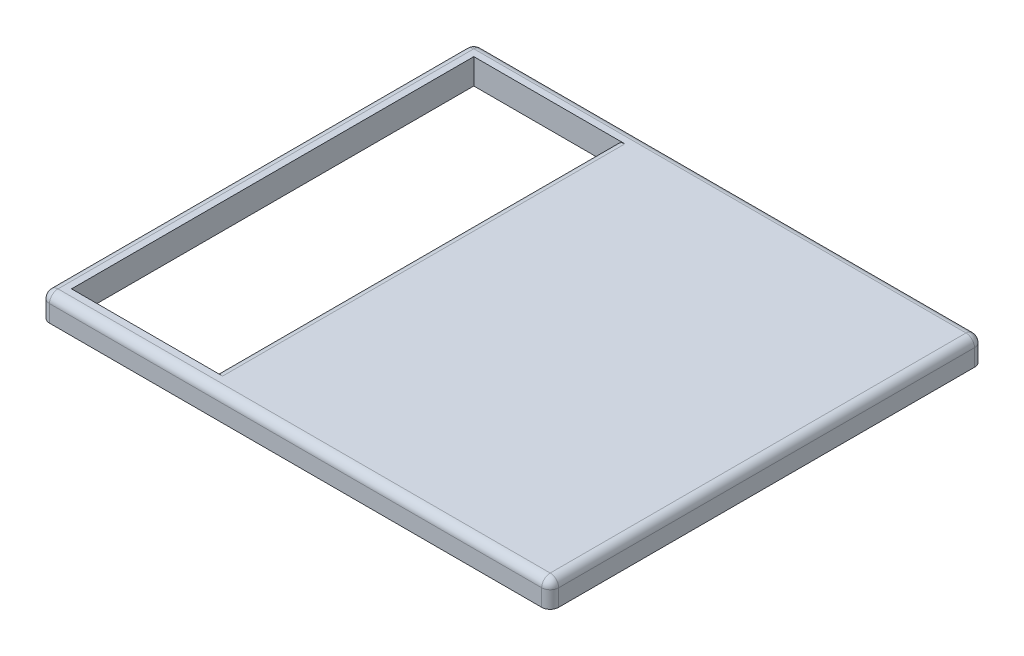
ISO-10303-21;
HEADER;
FILE_DESCRIPTION(('STEP AP214'),'2;1');
FILE_NAME('part.step','',(''),(''),'','','');
FILE_SCHEMA(('AUTOMOTIVE_DESIGN { 1 0 10303 214 1 1 1 1 }'));
ENDSEC;
DATA;
#1=APPLICATION_CONTEXT('core data for automotive mechanical design processes');
#2=APPLICATION_PROTOCOL_DEFINITION('international standard','automotive_design',2000,#1);
#3=PRODUCT_CONTEXT('',#1,'mechanical');
#4=PRODUCT('Part','Part','',(#3));
#5=PRODUCT_RELATED_PRODUCT_CATEGORY('part','',(#4));
#6=PRODUCT_DEFINITION_FORMATION('','',#4);
#7=PRODUCT_DEFINITION_CONTEXT('part definition',#1,'design');
#8=PRODUCT_DEFINITION('design','',#6,#7);
#9=PRODUCT_DEFINITION_SHAPE('','',#8);
#10=(LENGTH_UNIT() NAMED_UNIT(*) SI_UNIT(.MILLI.,.METRE.));
#11=(NAMED_UNIT(*) PLANE_ANGLE_UNIT() SI_UNIT($,.RADIAN.));
#12=(NAMED_UNIT(*) SI_UNIT($,.STERADIAN.) SOLID_ANGLE_UNIT());
#13=UNCERTAINTY_MEASURE_WITH_UNIT(LENGTH_MEASURE(1.E-05),#10,'distance_accuracy_value','');
#14=(GEOMETRIC_REPRESENTATION_CONTEXT(3) GLOBAL_UNCERTAINTY_ASSIGNED_CONTEXT((#13)) GLOBAL_UNIT_ASSIGNED_CONTEXT((#10,
#11,#12)) REPRESENTATION_CONTEXT('',''));
#15=CARTESIAN_POINT('',(0.,0.,0.));
#16=DIRECTION('',(0.,0.,1.));
#17=DIRECTION('',(1.,0.,0.));
#18=AXIS2_PLACEMENT_3D('',#15,#16,#17);
#19=CARTESIAN_POINT('',(0.,20.,0.));
#20=DIRECTION('',(0.,1.,0.));
#21=DIRECTION('',(0.,0.,1.));
#22=AXIS2_PLACEMENT_3D('',#19,#20,#21);
#23=PLANE('',#22);
#24=CARTESIAN_POINT('',(33.33,20.,38.33));
#25=DIRECTION('',(0.,1.,0.));
#26=DIRECTION('',(0.,0.,1.));
#27=AXIS2_PLACEMENT_3D('',#24,#25,#26);
#28=CIRCLE('',#27,1.67);
#29=CARTESIAN_POINT('',(35.,20.,38.33));
#30=VERTEX_POINT('',#29);
#31=CARTESIAN_POINT('',(33.33,20.,40.));
#32=VERTEX_POINT('',#31);
#33=EDGE_CURVE('E289',#30,#32,#28,.F.);
#34=ORIENTED_EDGE('',*,*,#33,.T.);
#35=DIRECTION('',(-1.,0.,0.));
#36=VECTOR('',#35,1.);
#37=CARTESIAN_POINT('',(0.,20.,40.));
#38=LINE('',#37,#36);
#39=CARTESIAN_POINT('',(-63.33,20.,40.));
#40=VERTEX_POINT('',#39);
#41=EDGE_CURVE('E293',#32,#40,#38,.T.);
#42=ORIENTED_EDGE('',*,*,#41,.T.);
#43=CARTESIAN_POINT('',(-63.33,20.,38.33));
#44=DIRECTION('',(0.,1.,0.));
#45=DIRECTION('',(0.,0.,1.));
#46=AXIS2_PLACEMENT_3D('',#43,#44,#45);
#47=CIRCLE('',#46,1.67);
#48=CARTESIAN_POINT('',(-65.,20.,38.33));
#49=VERTEX_POINT('',#48);
#50=EDGE_CURVE('E48',#40,#49,#47,.F.);
#51=ORIENTED_EDGE('',*,*,#50,.T.);
#52=DIRECTION('',(0.,0.,-1.));
#53=VECTOR('',#52,1.);
#54=CARTESIAN_POINT('',(-65.,20.,0.));
#55=LINE('',#54,#53);
#56=CARTESIAN_POINT('',(-65.,20.,-43.33));
#57=VERTEX_POINT('',#56);
#58=EDGE_CURVE('E291',#49,#57,#55,.T.);
#59=ORIENTED_EDGE('',*,*,#58,.T.);
#60=CARTESIAN_POINT('',(-63.33,20.,-43.33));
#61=DIRECTION('',(0.,1.,0.));
#62=DIRECTION('',(0.,0.,1.));
#63=AXIS2_PLACEMENT_3D('',#60,#61,#62);
#64=CIRCLE('',#63,1.67);
#65=CARTESIAN_POINT('',(-63.33,20.,-45.));
#66=VERTEX_POINT('',#65);
#67=EDGE_CURVE('E11',#57,#66,#64,.F.);
#68=ORIENTED_EDGE('',*,*,#67,.T.);
#69=DIRECTION('',(1.,0.,0.));
#70=VECTOR('',#69,1.);
#71=CARTESIAN_POINT('',(0.,20.,-45.));
#72=LINE('',#71,#70);
#73=CARTESIAN_POINT('',(33.33,20.,-45.));
#74=VERTEX_POINT('',#73);
#75=EDGE_CURVE('E62',#66,#74,#72,.T.);
#76=ORIENTED_EDGE('',*,*,#75,.T.);
#77=CARTESIAN_POINT('',(33.33,20.,-43.33));
#78=DIRECTION('',(0.,1.,0.));
#79=DIRECTION('',(0.,0.,1.));
#80=AXIS2_PLACEMENT_3D('',#77,#78,#79);
#81=CIRCLE('',#80,1.67);
#82=CARTESIAN_POINT('',(35.,20.,-43.33));
#83=VERTEX_POINT('',#82);
#84=EDGE_CURVE('E296',#74,#83,#81,.F.);
#85=ORIENTED_EDGE('',*,*,#84,.T.);
#86=DIRECTION('',(0.,0.,1.));
#87=VECTOR('',#86,1.);
#88=CARTESIAN_POINT('',(35.,20.,0.));
#89=LINE('',#88,#87);
#90=EDGE_CURVE('E290',#83,#30,#89,.T.);
#91=ORIENTED_EDGE('',*,*,#90,.T.);
#92=EDGE_LOOP('',(#34,#42,#51,#59,#68,#76,#85,#91));
#93=FACE_BOUND('',#92,.T.);
#94=DIRECTION('',(0.,0.,-1.));
#95=VECTOR('',#94,1.);
#96=CARTESIAN_POINT('',(-62.,20.,-42.));
#97=LINE('',#96,#95);
#98=CARTESIAN_POINT('',(-62.,20.,37.));
#99=VERTEX_POINT('',#98);
#100=CARTESIAN_POINT('',(-62.,20.,-42.));
#101=VERTEX_POINT('',#100);
#102=EDGE_CURVE('E259',#99,#101,#97,.T.);
#103=ORIENTED_EDGE('',*,*,#102,.F.);
#104=DIRECTION('',(-1.,0.,0.));
#105=VECTOR('',#104,1.);
#106=CARTESIAN_POINT('',(-62.,20.,37.));
#107=LINE('',#106,#105);
#108=CARTESIAN_POINT('',(32.,20.,37.));
#109=VERTEX_POINT('',#108);
#110=EDGE_CURVE('E306',#109,#99,#107,.T.);
#111=ORIENTED_EDGE('',*,*,#110,.F.);
#112=DIRECTION('',(0.,0.,1.));
#113=VECTOR('',#112,1.);
#114=CARTESIAN_POINT('',(32.,20.,37.));
#115=LINE('',#114,#113);
#116=CARTESIAN_POINT('',(32.,20.,-42.));
#117=VERTEX_POINT('',#116);
#118=EDGE_CURVE('E307',#117,#109,#115,.T.);
#119=ORIENTED_EDGE('',*,*,#118,.F.);
#120=DIRECTION('',(1.,0.,0.));
#121=VECTOR('',#120,1.);
#122=CARTESIAN_POINT('',(32.,20.,-42.));
#123=LINE('',#122,#121);
#124=EDGE_CURVE('E43',#101,#117,#123,.T.);
#125=ORIENTED_EDGE('',*,*,#124,.F.);
#126=EDGE_LOOP('',(#103,#111,#119,#125));
#127=FACE_BOUND('',#126,.T.);
#128=ADVANCED_FACE('F40',(#93,#127),#23,.F.);
#129=CARTESIAN_POINT('',(32.,3.,-42.));
#130=DIRECTION('',(0.,0.,-1.));
#131=DIRECTION('',(-1.,0.,0.));
#132=AXIS2_PLACEMENT_3D('',#129,#130,#131);
#133=PLANE('',#132);
#134=DIRECTION('',(0.,1.,0.));
#135=VECTOR('',#134,1.);
#136=CARTESIAN_POINT('',(-62.,3.,-42.));
#137=LINE('',#136,#135);
#138=CARTESIAN_POINT('',(-62.,25.,-42.));
#139=VERTEX_POINT('',#138);
#140=EDGE_CURVE('E200',#101,#139,#137,.T.);
#141=ORIENTED_EDGE('',*,*,#140,.F.);
#142=ORIENTED_EDGE('',*,*,#124,.T.);
#143=DIRECTION('',(0.,1.,0.));
#144=VECTOR('',#143,1.);
#145=CARTESIAN_POINT('',(32.,3.,-42.));
#146=LINE('',#145,#144);
#147=CARTESIAN_POINT('',(32.,23.,-42.));
#148=VERTEX_POINT('',#147);
#149=EDGE_CURVE('E160',#117,#148,#146,.T.);
#150=ORIENTED_EDGE('',*,*,#149,.T.);
#151=DIRECTION('',(1.,0.,0.));
#152=VECTOR('',#151,1.);
#153=CARTESIAN_POINT('',(32.,23.,-42.));
#154=LINE('',#153,#152);
#155=CARTESIAN_POINT('',(-34.,23.,-42.));
#156=VERTEX_POINT('',#155);
#157=EDGE_CURVE('E165',#156,#148,#154,.T.);
#158=ORIENTED_EDGE('',*,*,#157,.F.);
#159=DIRECTION('',(0.,1.,0.));
#160=VECTOR('',#159,1.);
#161=CARTESIAN_POINT('',(-34.,3.,-42.));
#162=LINE('',#161,#160);
#163=CARTESIAN_POINT('',(-34.,23.33,-42.));
#164=VERTEX_POINT('',#163);
#165=EDGE_CURVE('E182',#156,#164,#162,.T.);
#166=ORIENTED_EDGE('',*,*,#165,.T.);
#167=CARTESIAN_POINT('',(-32.33,23.33,-42.));
#168=DIRECTION('',(0.,0.,-1.));
#169=DIRECTION('',(-1.,0.,0.));
#170=AXIS2_PLACEMENT_3D('',#167,#168,#169);
#171=CIRCLE('',#170,1.67);
#172=CARTESIAN_POINT('',(-32.33,25.,-42.));
#173=VERTEX_POINT('',#172);
#174=EDGE_CURVE('E254',#164,#173,#171,.T.);
#175=ORIENTED_EDGE('',*,*,#174,.T.);
#176=DIRECTION('',(-1.,0.,0.));
#177=VECTOR('',#176,1.);
#178=CARTESIAN_POINT('',(32.,25.,-42.));
#179=LINE('',#178,#177);
#180=EDGE_CURVE('E181',#173,#139,#179,.T.);
#181=ORIENTED_EDGE('',*,*,#180,.T.);
#182=EDGE_LOOP('',(#141,#142,#150,#158,#166,#175,#181));
#183=FACE_BOUND('',#182,.T.);
#184=ADVANCED_FACE('F163',(#183),#133,.F.);
#185=CARTESIAN_POINT('',(32.,3.,37.));
#186=DIRECTION('',(1.,0.,0.));
#187=DIRECTION('',(0.,0.,-1.));
#188=AXIS2_PLACEMENT_3D('',#185,#186,#187);
#189=PLANE('',#188);
#190=ORIENTED_EDGE('',*,*,#149,.F.);
#191=ORIENTED_EDGE('',*,*,#118,.T.);
#192=DIRECTION('',(0.,1.,0.));
#193=VECTOR('',#192,1.);
#194=CARTESIAN_POINT('',(32.,3.,37.));
#195=LINE('',#194,#193);
#196=CARTESIAN_POINT('',(32.,23.,37.));
#197=VERTEX_POINT('',#196);
#198=EDGE_CURVE('E170',#109,#197,#195,.T.);
#199=ORIENTED_EDGE('',*,*,#198,.T.);
#200=DIRECTION('',(0.,0.,1.));
#201=VECTOR('',#200,1.);
#202=CARTESIAN_POINT('',(32.,23.,-45.));
#203=LINE('',#202,#201);
#204=EDGE_CURVE('E177',#148,#197,#203,.T.);
#205=ORIENTED_EDGE('',*,*,#204,.F.);
#206=EDGE_LOOP('',(#190,#191,#199,#205));
#207=FACE_BOUND('',#206,.T.);
#208=ADVANCED_FACE('F184',(#207),#189,.F.);
#209=CARTESIAN_POINT('',(-62.,3.,37.));
#210=DIRECTION('',(0.,0.,1.));
#211=DIRECTION('',(1.,0.,0.));
#212=AXIS2_PLACEMENT_3D('',#209,#210,#211);
#213=PLANE('',#212);
#214=ORIENTED_EDGE('',*,*,#198,.F.);
#215=ORIENTED_EDGE('',*,*,#110,.T.);
#216=DIRECTION('',(0.,1.,0.));
#217=VECTOR('',#216,1.);
#218=CARTESIAN_POINT('',(-62.,3.,37.));
#219=LINE('',#218,#217);
#220=CARTESIAN_POINT('',(-62.,25.,37.));
#221=VERTEX_POINT('',#220);
#222=EDGE_CURVE('E203',#99,#221,#219,.T.);
#223=ORIENTED_EDGE('',*,*,#222,.T.);
#224=DIRECTION('',(1.,0.,0.));
#225=VECTOR('',#224,1.);
#226=CARTESIAN_POINT('',(-62.,25.,37.));
#227=LINE('',#226,#225);
#228=CARTESIAN_POINT('',(-32.33,25.,37.));
#229=VERTEX_POINT('',#228);
#230=EDGE_CURVE('E199',#221,#229,#227,.T.);
#231=ORIENTED_EDGE('',*,*,#230,.T.);
#232=CARTESIAN_POINT('',(-32.33,23.33,37.));
#233=DIRECTION('',(0.,0.,1.));
#234=DIRECTION('',(1.,0.,0.));
#235=AXIS2_PLACEMENT_3D('',#232,#233,#234);
#236=CIRCLE('',#235,1.67);
#237=CARTESIAN_POINT('',(-34.,23.33,37.));
#238=VERTEX_POINT('',#237);
#239=EDGE_CURVE('E257',#229,#238,#236,.T.);
#240=ORIENTED_EDGE('',*,*,#239,.T.);
#241=DIRECTION('',(0.,-1.,0.));
#242=VECTOR('',#241,1.);
#243=CARTESIAN_POINT('',(-34.,3.,37.));
#244=LINE('',#243,#242);
#245=CARTESIAN_POINT('',(-34.,23.,37.));
#246=VERTEX_POINT('',#245);
#247=EDGE_CURVE('E169',#238,#246,#244,.T.);
#248=ORIENTED_EDGE('',*,*,#247,.T.);
#249=DIRECTION('',(-1.,0.,0.));
#250=VECTOR('',#249,1.);
#251=CARTESIAN_POINT('',(-62.,23.,37.));
#252=LINE('',#251,#250);
#253=EDGE_CURVE('E207',#197,#246,#252,.T.);
#254=ORIENTED_EDGE('',*,*,#253,.F.);
#255=EDGE_LOOP('',(#214,#215,#223,#231,#240,#248,#254));
#256=FACE_BOUND('',#255,.T.);
#257=ADVANCED_FACE('F313',(#256),#213,.F.);
#258=CARTESIAN_POINT('',(-65.,25.,0.));
#259=DIRECTION('',(-1.,0.,0.));
#260=DIRECTION('',(0.,0.,1.));
#261=AXIS2_PLACEMENT_3D('',#258,#259,#260);
#262=PLANE('',#261);
#263=ORIENTED_EDGE('',*,*,#58,.F.);
#264=DIRECTION('',(0.,-1.,0.));
#265=VECTOR('',#264,1.);
#266=CARTESIAN_POINT('',(-65.,25.,38.33));
#267=LINE('',#266,#265);
#268=CARTESIAN_POINT('',(-65.,23.33,38.33));
#269=VERTEX_POINT('',#268);
#270=EDGE_CURVE('E230',#49,#269,#267,.F.);
#271=ORIENTED_EDGE('',*,*,#270,.T.);
#272=DIRECTION('',(0.,0.,-1.));
#273=VECTOR('',#272,1.);
#274=CARTESIAN_POINT('',(-65.,23.33,0.));
#275=LINE('',#274,#273);
#276=CARTESIAN_POINT('',(-65.,23.33,-43.33));
#277=VERTEX_POINT('',#276);
#278=EDGE_CURVE('E227',#269,#277,#275,.T.);
#279=ORIENTED_EDGE('',*,*,#278,.T.);
#280=DIRECTION('',(0.,-1.,0.));
#281=VECTOR('',#280,1.);
#282=CARTESIAN_POINT('',(-65.,25.,-43.33));
#283=LINE('',#282,#281);
#284=EDGE_CURVE('E224',#277,#57,#283,.T.);
#285=ORIENTED_EDGE('',*,*,#284,.T.);
#286=EDGE_LOOP('',(#263,#271,#279,#285));
#287=FACE_BOUND('',#286,.T.);
#288=ADVANCED_FACE('F431',(#287),#262,.T.);
#289=CARTESIAN_POINT('',(0.,25.,40.));
#290=DIRECTION('',(0.,0.,1.));
#291=DIRECTION('',(1.,0.,0.));
#292=AXIS2_PLACEMENT_3D('',#289,#290,#291);
#293=PLANE('',#292);
#294=ORIENTED_EDGE('',*,*,#41,.F.);
#295=DIRECTION('',(0.,-1.,0.));
#296=VECTOR('',#295,1.);
#297=CARTESIAN_POINT('',(33.33,25.,40.));
#298=LINE('',#297,#296);
#299=CARTESIAN_POINT('',(33.33,23.33,40.));
#300=VERTEX_POINT('',#299);
#301=EDGE_CURVE('E245',#32,#300,#298,.F.);
#302=ORIENTED_EDGE('',*,*,#301,.T.);
#303=DIRECTION('',(-1.,0.,0.));
#304=VECTOR('',#303,1.);
#305=CARTESIAN_POINT('',(0.,23.33,40.));
#306=LINE('',#305,#304);
#307=CARTESIAN_POINT('',(-63.33,23.33,40.));
#308=VERTEX_POINT('',#307);
#309=EDGE_CURVE('E242',#300,#308,#306,.T.);
#310=ORIENTED_EDGE('',*,*,#309,.T.);
#311=DIRECTION('',(0.,-1.,0.));
#312=VECTOR('',#311,1.);
#313=CARTESIAN_POINT('',(-63.33,25.,40.));
#314=LINE('',#313,#312);
#315=EDGE_CURVE('E239',#308,#40,#314,.T.);
#316=ORIENTED_EDGE('',*,*,#315,.T.);
#317=EDGE_LOOP('',(#294,#302,#310,#316));
#318=FACE_BOUND('',#317,.T.);
#319=ADVANCED_FACE('F426',(#318),#293,.T.);
#320=CARTESIAN_POINT('',(35.,25.,0.));
#321=DIRECTION('',(1.,0.,0.));
#322=DIRECTION('',(0.,0.,-1.));
#323=AXIS2_PLACEMENT_3D('',#320,#321,#322);
#324=PLANE('',#323);
#325=ORIENTED_EDGE('',*,*,#90,.F.);
#326=DIRECTION('',(0.,-1.,0.));
#327=VECTOR('',#326,1.);
#328=CARTESIAN_POINT('',(35.,25.,-43.33));
#329=LINE('',#328,#327);
#330=CARTESIAN_POINT('',(35.,23.33,-43.33));
#331=VERTEX_POINT('',#330);
#332=EDGE_CURVE('E232',#83,#331,#329,.F.);
#333=ORIENTED_EDGE('',*,*,#332,.T.);
#334=DIRECTION('',(0.,0.,1.));
#335=VECTOR('',#334,1.);
#336=CARTESIAN_POINT('',(35.,23.33,0.));
#337=LINE('',#336,#335);
#338=CARTESIAN_POINT('',(35.,23.33,38.33));
#339=VERTEX_POINT('',#338);
#340=EDGE_CURVE('E234',#331,#339,#337,.T.);
#341=ORIENTED_EDGE('',*,*,#340,.T.);
#342=DIRECTION('',(0.,-1.,0.));
#343=VECTOR('',#342,1.);
#344=CARTESIAN_POINT('',(35.,25.,38.33));
#345=LINE('',#344,#343);
#346=EDGE_CURVE('E236',#339,#30,#345,.T.);
#347=ORIENTED_EDGE('',*,*,#346,.T.);
#348=EDGE_LOOP('',(#325,#333,#341,#347));
#349=FACE_BOUND('',#348,.T.);
#350=ADVANCED_FACE('F408',(#349),#324,.T.);
#351=CARTESIAN_POINT('',(0.,25.,-45.));
#352=DIRECTION('',(0.,0.,-1.));
#353=DIRECTION('',(-1.,0.,0.));
#354=AXIS2_PLACEMENT_3D('',#351,#352,#353);
#355=PLANE('',#354);
#356=ORIENTED_EDGE('',*,*,#75,.F.);
#357=DIRECTION('',(0.,-1.,0.));
#358=VECTOR('',#357,1.);
#359=CARTESIAN_POINT('',(-63.33,25.,-45.));
#360=LINE('',#359,#358);
#361=CARTESIAN_POINT('',(-63.33,23.33,-45.));
#362=VERTEX_POINT('',#361);
#363=EDGE_CURVE('E252',#66,#362,#360,.F.);
#364=ORIENTED_EDGE('',*,*,#363,.T.);
#365=DIRECTION('',(1.,0.,0.));
#366=VECTOR('',#365,1.);
#367=CARTESIAN_POINT('',(0.,23.33,-45.));
#368=LINE('',#367,#366);
#369=CARTESIAN_POINT('',(33.33,23.33,-45.));
#370=VERTEX_POINT('',#369);
#371=EDGE_CURVE('E249',#362,#370,#368,.T.);
#372=ORIENTED_EDGE('',*,*,#371,.T.);
#373=DIRECTION('',(0.,-1.,0.));
#374=VECTOR('',#373,1.);
#375=CARTESIAN_POINT('',(33.33,25.,-45.));
#376=LINE('',#375,#374);
#377=EDGE_CURVE('E247',#370,#74,#376,.T.);
#378=ORIENTED_EDGE('',*,*,#377,.T.);
#379=EDGE_LOOP('',(#356,#364,#372,#378));
#380=FACE_BOUND('',#379,.T.);
#381=ADVANCED_FACE('F336',(#380),#355,.T.);
#382=CARTESIAN_POINT('',(0.,25.,0.));
#383=DIRECTION('',(0.,1.,0.));
#384=DIRECTION('',(0.,0.,1.));
#385=AXIS2_PLACEMENT_3D('',#382,#383,#384);
#386=PLANE('',#385);
#387=DIRECTION('',(1.,0.,0.));
#388=VECTOR('',#387,1.);
#389=CARTESIAN_POINT('',(0.,25.,-43.33));
#390=LINE('',#389,#388);
#391=CARTESIAN_POINT('',(33.33,25.,-43.33));
#392=VERTEX_POINT('',#391);
#393=CARTESIAN_POINT('',(-63.33,25.,-43.33));
#394=VERTEX_POINT('',#393);
#395=EDGE_CURVE('E214',#392,#394,#390,.F.);
#396=ORIENTED_EDGE('',*,*,#395,.T.);
#397=DIRECTION('',(0.,0.,-1.));
#398=VECTOR('',#397,1.);
#399=CARTESIAN_POINT('',(-63.33,25.,0.));
#400=LINE('',#399,#398);
#401=CARTESIAN_POINT('',(-63.33,25.,38.33));
#402=VERTEX_POINT('',#401);
#403=EDGE_CURVE('E218',#394,#402,#400,.F.);
#404=ORIENTED_EDGE('',*,*,#403,.T.);
#405=DIRECTION('',(-1.,0.,0.));
#406=VECTOR('',#405,1.);
#407=CARTESIAN_POINT('',(0.,25.,38.33));
#408=LINE('',#407,#406);
#409=CARTESIAN_POINT('',(33.33,25.,38.33));
#410=VERTEX_POINT('',#409);
#411=EDGE_CURVE('E216',#402,#410,#408,.F.);
#412=ORIENTED_EDGE('',*,*,#411,.T.);
#413=DIRECTION('',(0.,0.,1.));
#414=VECTOR('',#413,1.);
#415=CARTESIAN_POINT('',(33.33,25.,0.));
#416=LINE('',#415,#414);
#417=EDGE_CURVE('E212',#410,#392,#416,.F.);
#418=ORIENTED_EDGE('',*,*,#417,.T.);
#419=EDGE_LOOP('',(#396,#404,#412,#418));
#420=FACE_BOUND('',#419,.T.);
#421=ORIENTED_EDGE('',*,*,#180,.F.);
#422=DIRECTION('',(0.,0.,-1.));
#423=VECTOR('',#422,1.);
#424=CARTESIAN_POINT('',(-32.33,25.,0.));
#425=LINE('',#424,#423);
#426=EDGE_CURVE('E221',#173,#229,#425,.F.);
#427=ORIENTED_EDGE('',*,*,#426,.T.);
#428=ORIENTED_EDGE('',*,*,#230,.F.);
#429=DIRECTION('',(0.,0.,1.));
#430=VECTOR('',#429,1.);
#431=CARTESIAN_POINT('',(-62.,25.,-42.));
#432=LINE('',#431,#430);
#433=EDGE_CURVE('E196',#139,#221,#432,.T.);
#434=ORIENTED_EDGE('',*,*,#433,.F.);
#435=EDGE_LOOP('',(#421,#427,#428,#434));
#436=FACE_BOUND('',#435,.T.);
#437=ADVANCED_FACE('F325',(#420,#436),#386,.T.);
#438=CARTESIAN_POINT('',(-62.,3.,-42.));
#439=DIRECTION('',(-1.,0.,0.));
#440=DIRECTION('',(0.,0.,1.));
#441=AXIS2_PLACEMENT_3D('',#438,#439,#440);
#442=PLANE('',#441);
#443=ORIENTED_EDGE('',*,*,#222,.F.);
#444=ORIENTED_EDGE('',*,*,#102,.T.);
#445=ORIENTED_EDGE('',*,*,#140,.T.);
#446=ORIENTED_EDGE('',*,*,#433,.T.);
#447=EDGE_LOOP('',(#443,#444,#445,#446));
#448=FACE_BOUND('',#447,.T.);
#449=ADVANCED_FACE('F327',(#448),#442,.F.);
#450=CARTESIAN_POINT('',(-34.,23.,-45.));
#451=DIRECTION('',(0.,1.,0.));
#452=DIRECTION('',(0.,0.,1.));
#453=AXIS2_PLACEMENT_3D('',#450,#451,#452);
#454=PLANE('',#453);
#455=DIRECTION('',(0.,0.,1.));
#456=VECTOR('',#455,1.);
#457=CARTESIAN_POINT('',(-34.,23.,-45.));
#458=LINE('',#457,#456);
#459=EDGE_CURVE('E180',#156,#246,#458,.T.);
#460=ORIENTED_EDGE('',*,*,#459,.F.);
#461=ORIENTED_EDGE('',*,*,#157,.T.);
#462=ORIENTED_EDGE('',*,*,#204,.T.);
#463=ORIENTED_EDGE('',*,*,#253,.T.);
#464=EDGE_LOOP('',(#460,#461,#462,#463));
#465=FACE_BOUND('',#464,.T.);
#466=ADVANCED_FACE('F175',(#465),#454,.F.);
#467=CARTESIAN_POINT('',(-34.,0.,0.));
#468=DIRECTION('',(-1.,0.,0.));
#469=DIRECTION('',(0.,0.,1.));
#470=AXIS2_PLACEMENT_3D('',#467,#468,#469);
#471=PLANE('',#470);
#472=ORIENTED_EDGE('',*,*,#247,.F.);
#473=DIRECTION('',(0.,0.,-1.));
#474=VECTOR('',#473,1.);
#475=CARTESIAN_POINT('',(-34.,23.33,0.));
#476=LINE('',#475,#474);
#477=EDGE_CURVE('E209',#238,#164,#476,.T.);
#478=ORIENTED_EDGE('',*,*,#477,.T.);
#479=ORIENTED_EDGE('',*,*,#165,.F.);
#480=ORIENTED_EDGE('',*,*,#459,.T.);
#481=EDGE_LOOP('',(#472,#478,#479,#480));
#482=FACE_BOUND('',#481,.T.);
#483=ADVANCED_FACE('F318',(#482),#471,.T.);
#484=CARTESIAN_POINT('',(-32.33,23.33,0.));
#485=DIRECTION('',(0.,0.,-1.));
#486=DIRECTION('',(-1.,0.,0.));
#487=AXIS2_PLACEMENT_3D('',#484,#485,#486);
#488=CYLINDRICAL_SURFACE('',#487,1.67);
#489=ORIENTED_EDGE('',*,*,#239,.F.);
#490=ORIENTED_EDGE('',*,*,#426,.F.);
#491=ORIENTED_EDGE('',*,*,#174,.F.);
#492=ORIENTED_EDGE('',*,*,#477,.F.);
#493=EDGE_LOOP('',(#489,#490,#491,#492));
#494=FACE_BOUND('',#493,.T.);
#495=ADVANCED_FACE('F322',(#494),#488,.T.);
#496=CARTESIAN_POINT('',(33.33,25.,38.33));
#497=DIRECTION('',(0.,-1.,0.));
#498=DIRECTION('',(0.,0.,-1.));
#499=AXIS2_PLACEMENT_3D('',#496,#497,#498);
#500=CYLINDRICAL_SURFACE('',#499,1.67);
#501=ORIENTED_EDGE('',*,*,#33,.F.);
#502=ORIENTED_EDGE('',*,*,#346,.F.);
#503=CARTESIAN_POINT('',(33.33,23.33,38.33));
#504=DIRECTION('',(0.,1.,0.));
#505=DIRECTION('',(0.,0.,1.));
#506=AXIS2_PLACEMENT_3D('',#503,#504,#505);
#507=CIRCLE('',#506,1.67);
#508=EDGE_CURVE('E190',#300,#339,#507,.T.);
#509=ORIENTED_EDGE('',*,*,#508,.F.);
#510=ORIENTED_EDGE('',*,*,#301,.F.);
#511=EDGE_LOOP('',(#501,#502,#509,#510));
#512=FACE_BOUND('',#511,.T.);
#513=ADVANCED_FACE('F394',(#512),#500,.T.);
#514=CARTESIAN_POINT('',(33.33,25.,-43.33));
#515=DIRECTION('',(0.,-1.,0.));
#516=DIRECTION('',(0.,0.,-1.));
#517=AXIS2_PLACEMENT_3D('',#514,#515,#516);
#518=CYLINDRICAL_SURFACE('',#517,1.67);
#519=ORIENTED_EDGE('',*,*,#84,.F.);
#520=ORIENTED_EDGE('',*,*,#377,.F.);
#521=CARTESIAN_POINT('',(33.33,23.33,-43.33));
#522=DIRECTION('',(0.,1.,0.));
#523=DIRECTION('',(0.,0.,1.));
#524=AXIS2_PLACEMENT_3D('',#521,#522,#523);
#525=CIRCLE('',#524,1.67);
#526=EDGE_CURVE('E283',#331,#370,#525,.T.);
#527=ORIENTED_EDGE('',*,*,#526,.F.);
#528=ORIENTED_EDGE('',*,*,#332,.F.);
#529=EDGE_LOOP('',(#519,#520,#527,#528));
#530=FACE_BOUND('',#529,.T.);
#531=ADVANCED_FACE('F391',(#530),#518,.T.);
#532=CARTESIAN_POINT('',(33.33,23.33,0.));
#533=DIRECTION('',(0.,0.,1.));
#534=DIRECTION('',(1.,0.,0.));
#535=AXIS2_PLACEMENT_3D('',#532,#533,#534);
#536=CYLINDRICAL_SURFACE('',#535,1.67);
#537=CARTESIAN_POINT('',(33.33,23.33,38.33));
#538=DIRECTION('',(0.,0.,1.));
#539=DIRECTION('',(1.,0.,0.));
#540=AXIS2_PLACEMENT_3D('',#537,#538,#539);
#541=CIRCLE('',#540,1.67);
#542=EDGE_CURVE('E186',#339,#410,#541,.T.);
#543=ORIENTED_EDGE('',*,*,#542,.F.);
#544=ORIENTED_EDGE('',*,*,#340,.F.);
#545=CARTESIAN_POINT('',(33.33,23.33,-43.33));
#546=DIRECTION('',(0.,0.,-1.));
#547=DIRECTION('',(-1.,0.,0.));
#548=AXIS2_PLACEMENT_3D('',#545,#546,#547);
#549=CIRCLE('',#548,1.67);
#550=EDGE_CURVE('E280',#392,#331,#549,.T.);
#551=ORIENTED_EDGE('',*,*,#550,.F.);
#552=ORIENTED_EDGE('',*,*,#417,.F.);
#553=EDGE_LOOP('',(#543,#544,#551,#552));
#554=FACE_BOUND('',#553,.T.);
#555=ADVANCED_FACE('F387',(#554),#536,.T.);
#556=CARTESIAN_POINT('',(33.33,23.33,38.33));
#557=DIRECTION('',(1.,0.,0.));
#558=DIRECTION('',(0.,0.,-1.));
#559=AXIS2_PLACEMENT_3D('',#556,#557,#558);
#560=SPHERICAL_SURFACE('',#559,1.67);
#561=ORIENTED_EDGE('',*,*,#508,.T.);
#562=ORIENTED_EDGE('',*,*,#542,.T.);
#563=CARTESIAN_POINT('',(33.33,23.33,38.33));
#564=DIRECTION('',(1.,0.,0.));
#565=DIRECTION('',(0.,0.,-1.));
#566=AXIS2_PLACEMENT_3D('',#563,#564,#565);
#567=CIRCLE('',#566,1.67);
#568=EDGE_CURVE('E277',#300,#410,#567,.F.);
#569=ORIENTED_EDGE('',*,*,#568,.F.);
#570=EDGE_LOOP('',(#561,#562,#569));
#571=FACE_BOUND('',#570,.T.);
#572=ADVANCED_FACE('F383',(#571),#560,.T.);
#573=CARTESIAN_POINT('',(33.33,23.33,-43.33));
#574=DIRECTION('',(1.,0.,0.));
#575=DIRECTION('',(0.,0.,-1.));
#576=AXIS2_PLACEMENT_3D('',#573,#574,#575);
#577=SPHERICAL_SURFACE('',#576,1.67);
#578=ORIENTED_EDGE('',*,*,#550,.T.);
#579=ORIENTED_EDGE('',*,*,#526,.T.);
#580=CARTESIAN_POINT('',(33.33,23.33,-43.33));
#581=DIRECTION('',(1.,0.,0.));
#582=DIRECTION('',(0.,0.,-1.));
#583=AXIS2_PLACEMENT_3D('',#580,#581,#582);
#584=CIRCLE('',#583,1.67);
#585=EDGE_CURVE('E275',#392,#370,#584,.F.);
#586=ORIENTED_EDGE('',*,*,#585,.F.);
#587=EDGE_LOOP('',(#578,#579,#586));
#588=FACE_BOUND('',#587,.T.);
#589=ADVANCED_FACE('F379',(#588),#577,.T.);
#590=CARTESIAN_POINT('',(0.,23.33,38.33));
#591=DIRECTION('',(-1.,0.,0.));
#592=DIRECTION('',(0.,0.,1.));
#593=AXIS2_PLACEMENT_3D('',#590,#591,#592);
#594=CYLINDRICAL_SURFACE('',#593,1.67);
#595=ORIENTED_EDGE('',*,*,#568,.T.);
#596=ORIENTED_EDGE('',*,*,#411,.F.);
#597=CARTESIAN_POINT('',(-63.33,23.33,38.33));
#598=DIRECTION('',(-1.,0.,0.));
#599=DIRECTION('',(0.,0.,1.));
#600=AXIS2_PLACEMENT_3D('',#597,#598,#599);
#601=CIRCLE('',#600,1.67);
#602=EDGE_CURVE('E272',#308,#402,#601,.T.);
#603=ORIENTED_EDGE('',*,*,#602,.F.);
#604=ORIENTED_EDGE('',*,*,#309,.F.);
#605=EDGE_LOOP('',(#595,#596,#603,#604));
#606=FACE_BOUND('',#605,.T.);
#607=ADVANCED_FACE('F375',(#606),#594,.T.);
#608=CARTESIAN_POINT('',(-63.33,25.,38.33));
#609=DIRECTION('',(0.,-1.,0.));
#610=DIRECTION('',(0.,0.,-1.));
#611=AXIS2_PLACEMENT_3D('',#608,#609,#610);
#612=CYLINDRICAL_SURFACE('',#611,1.67);
#613=ORIENTED_EDGE('',*,*,#50,.F.);
#614=ORIENTED_EDGE('',*,*,#315,.F.);
#615=CARTESIAN_POINT('',(-63.33,23.33,38.33));
#616=DIRECTION('',(0.,1.,0.));
#617=DIRECTION('',(0.,0.,1.));
#618=AXIS2_PLACEMENT_3D('',#615,#616,#617);
#619=CIRCLE('',#618,1.67);
#620=EDGE_CURVE('E270',#269,#308,#619,.T.);
#621=ORIENTED_EDGE('',*,*,#620,.F.);
#622=ORIENTED_EDGE('',*,*,#270,.F.);
#623=EDGE_LOOP('',(#613,#614,#621,#622));
#624=FACE_BOUND('',#623,.T.);
#625=ADVANCED_FACE('F372',(#624),#612,.T.);
#626=CARTESIAN_POINT('',(-63.33,25.,-43.33));
#627=DIRECTION('',(0.,-1.,0.));
#628=DIRECTION('',(0.,0.,-1.));
#629=AXIS2_PLACEMENT_3D('',#626,#627,#628);
#630=CYLINDRICAL_SURFACE('',#629,1.67);
#631=ORIENTED_EDGE('',*,*,#67,.F.);
#632=ORIENTED_EDGE('',*,*,#284,.F.);
#633=CARTESIAN_POINT('',(-63.33,23.33,-43.33));
#634=DIRECTION('',(0.,1.,0.));
#635=DIRECTION('',(0.,0.,1.));
#636=AXIS2_PLACEMENT_3D('',#633,#634,#635);
#637=CIRCLE('',#636,1.67);
#638=EDGE_CURVE('E267',#362,#277,#637,.T.);
#639=ORIENTED_EDGE('',*,*,#638,.F.);
#640=ORIENTED_EDGE('',*,*,#363,.F.);
#641=EDGE_LOOP('',(#631,#632,#639,#640));
#642=FACE_BOUND('',#641,.T.);
#643=ADVANCED_FACE('F368',(#642),#630,.T.);
#644=CARTESIAN_POINT('',(0.,23.33,-43.33));
#645=DIRECTION('',(1.,0.,0.));
#646=DIRECTION('',(0.,0.,-1.));
#647=AXIS2_PLACEMENT_3D('',#644,#645,#646);
#648=CYLINDRICAL_SURFACE('',#647,1.67);
#649=ORIENTED_EDGE('',*,*,#585,.T.);
#650=ORIENTED_EDGE('',*,*,#371,.F.);
#651=CARTESIAN_POINT('',(-63.33,23.33,-43.33));
#652=DIRECTION('',(-1.,0.,0.));
#653=DIRECTION('',(0.,0.,1.));
#654=AXIS2_PLACEMENT_3D('',#651,#652,#653);
#655=CIRCLE('',#654,1.67);
#656=EDGE_CURVE('E264',#394,#362,#655,.T.);
#657=ORIENTED_EDGE('',*,*,#656,.F.);
#658=ORIENTED_EDGE('',*,*,#395,.F.);
#659=EDGE_LOOP('',(#649,#650,#657,#658));
#660=FACE_BOUND('',#659,.T.);
#661=ADVANCED_FACE('F364',(#660),#648,.T.);
#662=CARTESIAN_POINT('',(-63.33,23.33,38.33));
#663=DIRECTION('',(0.,0.,1.));
#664=DIRECTION('',(1.,0.,0.));
#665=AXIS2_PLACEMENT_3D('',#662,#663,#664);
#666=SPHERICAL_SURFACE('',#665,1.67);
#667=ORIENTED_EDGE('',*,*,#620,.T.);
#668=ORIENTED_EDGE('',*,*,#602,.T.);
#669=CARTESIAN_POINT('',(-63.33,23.33,38.33));
#670=DIRECTION('',(0.,0.,1.));
#671=DIRECTION('',(1.,0.,0.));
#672=AXIS2_PLACEMENT_3D('',#669,#670,#671);
#673=CIRCLE('',#672,1.67);
#674=EDGE_CURVE('E262',#269,#402,#673,.F.);
#675=ORIENTED_EDGE('',*,*,#674,.F.);
#676=EDGE_LOOP('',(#667,#668,#675));
#677=FACE_BOUND('',#676,.T.);
#678=ADVANCED_FACE('F356',(#677),#666,.T.);
#679=CARTESIAN_POINT('',(-63.33,23.33,-43.33));
#680=DIRECTION('',(0.,0.,-1.));
#681=DIRECTION('',(-1.,0.,0.));
#682=AXIS2_PLACEMENT_3D('',#679,#680,#681);
#683=SPHERICAL_SURFACE('',#682,1.67);
#684=ORIENTED_EDGE('',*,*,#656,.T.);
#685=ORIENTED_EDGE('',*,*,#638,.T.);
#686=CARTESIAN_POINT('',(-63.33,23.33,-43.33));
#687=DIRECTION('',(0.,0.,-1.));
#688=DIRECTION('',(-1.,0.,0.));
#689=AXIS2_PLACEMENT_3D('',#686,#687,#688);
#690=CIRCLE('',#689,1.67);
#691=EDGE_CURVE('E260',#394,#277,#690,.F.);
#692=ORIENTED_EDGE('',*,*,#691,.F.);
#693=EDGE_LOOP('',(#684,#685,#692));
#694=FACE_BOUND('',#693,.T.);
#695=ADVANCED_FACE('F349',(#694),#683,.T.);
#696=CARTESIAN_POINT('',(-63.33,23.33,0.));
#697=DIRECTION('',(0.,0.,-1.));
#698=DIRECTION('',(-1.,0.,0.));
#699=AXIS2_PLACEMENT_3D('',#696,#697,#698);
#700=CYLINDRICAL_SURFACE('',#699,1.67);
#701=ORIENTED_EDGE('',*,*,#674,.T.);
#702=ORIENTED_EDGE('',*,*,#403,.F.);
#703=ORIENTED_EDGE('',*,*,#691,.T.);
#704=ORIENTED_EDGE('',*,*,#278,.F.);
#705=EDGE_LOOP('',(#701,#702,#703,#704));
#706=FACE_BOUND('',#705,.T.);
#707=ADVANCED_FACE('F343',(#706),#700,.T.);
#708=CLOSED_SHELL('',(#128,#184,#208,#257,#288,#319,#350,#381,#437,#449,#466,#483,#495,#513,
#531,#555,#572,#589,#607,#625,#643,#661,#678,#695,#707));
#709=MANIFOLD_SOLID_BREP('B2',#708);
#710=ADVANCED_BREP_SHAPE_REPRESENTATION('',(#18,#709),#14);
#711=SHAPE_DEFINITION_REPRESENTATION(#9,#710);
ENDSEC;
END-ISO-10303-21;
